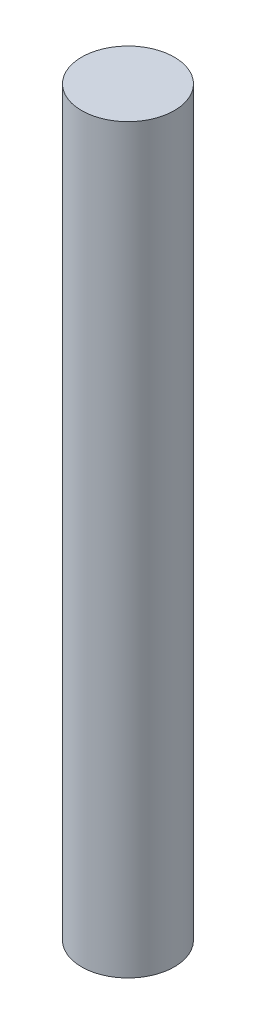
ISO-10303-21;
HEADER;
FILE_DESCRIPTION(('STEP AP214'),'2;1');
FILE_NAME('part.step','',(''),(''),'','','');
FILE_SCHEMA(('AUTOMOTIVE_DESIGN { 1 0 10303 214 1 1 1 1 }'));
ENDSEC;
DATA;
#1=APPLICATION_CONTEXT('core data for automotive mechanical design processes');
#2=APPLICATION_PROTOCOL_DEFINITION('international standard','automotive_design',2000,#1);
#3=PRODUCT_CONTEXT('',#1,'mechanical');
#4=PRODUCT('Part','Part','',(#3));
#5=PRODUCT_RELATED_PRODUCT_CATEGORY('part','',(#4));
#6=PRODUCT_DEFINITION_FORMATION('','',#4);
#7=PRODUCT_DEFINITION_CONTEXT('part definition',#1,'design');
#8=PRODUCT_DEFINITION('design','',#6,#7);
#9=PRODUCT_DEFINITION_SHAPE('','',#8);
#10=(LENGTH_UNIT() NAMED_UNIT(*) SI_UNIT(.MILLI.,.METRE.));
#11=(NAMED_UNIT(*) PLANE_ANGLE_UNIT() SI_UNIT($,.RADIAN.));
#12=(NAMED_UNIT(*) SI_UNIT($,.STERADIAN.) SOLID_ANGLE_UNIT());
#13=UNCERTAINTY_MEASURE_WITH_UNIT(LENGTH_MEASURE(1.E-05),#10,'distance_accuracy_value','');
#14=(GEOMETRIC_REPRESENTATION_CONTEXT(3) GLOBAL_UNCERTAINTY_ASSIGNED_CONTEXT((#13)) GLOBAL_UNIT_ASSIGNED_CONTEXT((#10,
#11,#12)) REPRESENTATION_CONTEXT('',''));
#15=CARTESIAN_POINT('',(0.,0.,0.));
#16=DIRECTION('',(0.,0.,1.));
#17=DIRECTION('',(1.,0.,0.));
#18=AXIS2_PLACEMENT_3D('',#15,#16,#17);
#19=CARTESIAN_POINT('',(0.,20.,0.));
#20=DIRECTION('',(0.,-1.,0.));
#21=DIRECTION('',(0.,0.,-1.));
#22=AXIS2_PLACEMENT_3D('',#19,#20,#21);
#23=CYLINDRICAL_SURFACE('',#22,2.5);
#24=CARTESIAN_POINT('',(0.,20.,0.));
#25=DIRECTION('',(0.,1.,0.));
#26=DIRECTION('',(0.,0.,1.));
#27=AXIS2_PLACEMENT_3D('',#24,#25,#26);
#28=CIRCLE('',#27,2.5);
#29=CARTESIAN_POINT('',(0.,20.,2.5));
#30=VERTEX_POINT('',#29);
#31=EDGE_CURVE('E10',#30,#30,#28,.T.);
#32=ORIENTED_EDGE('',*,*,#31,.F.);
#33=EDGE_LOOP('',(#32));
#34=FACE_BOUND('',#33,.T.);
#35=CARTESIAN_POINT('',(0.,-20.,0.));
#36=DIRECTION('',(0.,1.,0.));
#37=DIRECTION('',(0.,0.,1.));
#38=AXIS2_PLACEMENT_3D('',#35,#36,#37);
#39=CIRCLE('',#38,2.5);
#40=CARTESIAN_POINT('',(0.,-20.,2.5));
#41=VERTEX_POINT('',#40);
#42=EDGE_CURVE('E33',#41,#41,#39,.T.);
#43=ORIENTED_EDGE('',*,*,#42,.T.);
#44=EDGE_LOOP('',(#43));
#45=FACE_BOUND('',#44,.T.);
#46=ADVANCED_FACE('F30',(#34,#45),#23,.T.);
#47=CARTESIAN_POINT('',(0.,20.,0.));
#48=DIRECTION('',(0.,1.,0.));
#49=DIRECTION('',(0.,0.,1.));
#50=AXIS2_PLACEMENT_3D('',#47,#48,#49);
#51=PLANE('',#50);
#52=ORIENTED_EDGE('',*,*,#31,.T.);
#53=EDGE_LOOP('',(#52));
#54=FACE_BOUND('',#53,.T.);
#55=ADVANCED_FACE('F45',(#54),#51,.T.);
#56=CARTESIAN_POINT('',(0.,-20.,0.));
#57=DIRECTION('',(0.,1.,0.));
#58=DIRECTION('',(0.,0.,1.));
#59=AXIS2_PLACEMENT_3D('',#56,#57,#58);
#60=PLANE('',#59);
#61=ORIENTED_EDGE('',*,*,#42,.F.);
#62=EDGE_LOOP('',(#61));
#63=FACE_BOUND('',#62,.T.);
#64=ADVANCED_FACE('F43',(#63),#60,.F.);
#65=CLOSED_SHELL('',(#46,#55,#64));
#66=MANIFOLD_SOLID_BREP('B2',#65);
#67=ADVANCED_BREP_SHAPE_REPRESENTATION('',(#18,#66),#14);
#68=SHAPE_DEFINITION_REPRESENTATION(#9,#67);
ENDSEC;
END-ISO-10303-21;
